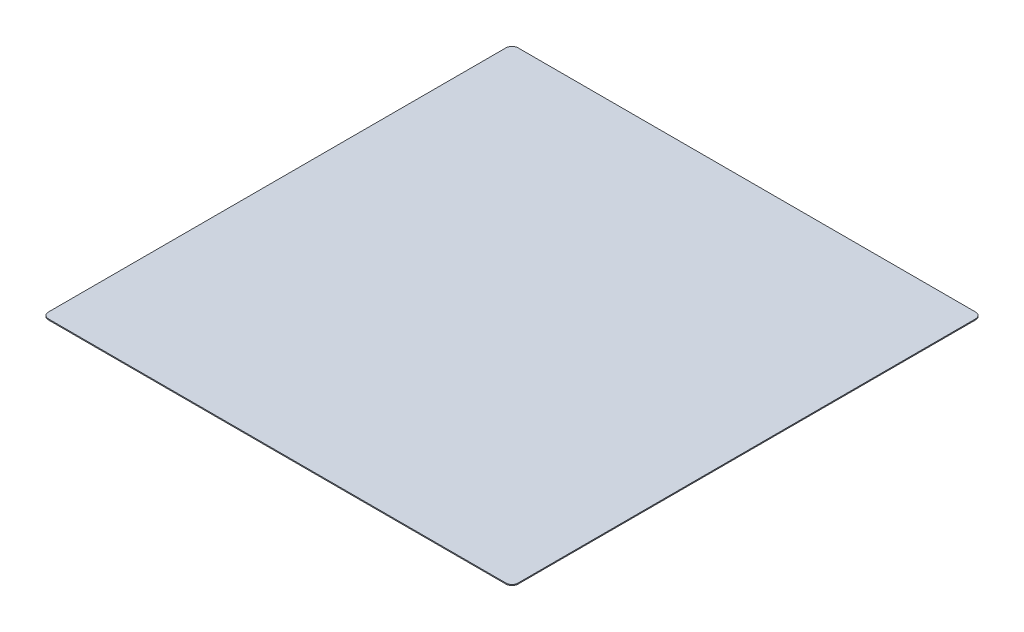
ISO-10303-21;
HEADER;
FILE_DESCRIPTION(('STEP AP214'),'2;1');
FILE_NAME('part.step','',(''),(''),'','','');
FILE_SCHEMA(('AUTOMOTIVE_DESIGN { 1 0 10303 214 1 1 1 1 }'));
ENDSEC;
DATA;
#1=APPLICATION_CONTEXT('core data for automotive mechanical design processes');
#2=APPLICATION_PROTOCOL_DEFINITION('international standard','automotive_design',2000,#1);
#3=PRODUCT_CONTEXT('',#1,'mechanical');
#4=PRODUCT('Part','Part','',(#3));
#5=PRODUCT_RELATED_PRODUCT_CATEGORY('part','',(#4));
#6=PRODUCT_DEFINITION_FORMATION('','',#4);
#7=PRODUCT_DEFINITION_CONTEXT('part definition',#1,'design');
#8=PRODUCT_DEFINITION('design','',#6,#7);
#9=PRODUCT_DEFINITION_SHAPE('','',#8);
#10=(LENGTH_UNIT() NAMED_UNIT(*) SI_UNIT(.MILLI.,.METRE.));
#11=(NAMED_UNIT(*) PLANE_ANGLE_UNIT() SI_UNIT($,.RADIAN.));
#12=(NAMED_UNIT(*) SI_UNIT($,.STERADIAN.) SOLID_ANGLE_UNIT());
#13=UNCERTAINTY_MEASURE_WITH_UNIT(LENGTH_MEASURE(1.E-05),#10,'distance_accuracy_value','');
#14=(GEOMETRIC_REPRESENTATION_CONTEXT(3) GLOBAL_UNCERTAINTY_ASSIGNED_CONTEXT((#13)) GLOBAL_UNIT_ASSIGNED_CONTEXT((#10,
#11,#12)) REPRESENTATION_CONTEXT('',''));
#15=CARTESIAN_POINT('',(0.,0.,0.));
#16=DIRECTION('',(0.,0.,1.));
#17=DIRECTION('',(1.,0.,0.));
#18=AXIS2_PLACEMENT_3D('',#15,#16,#17);
#19=CARTESIAN_POINT('',(-114.5,0.5,114.5));
#20=DIRECTION('',(0.,-1.,0.));
#21=DIRECTION('',(0.,0.,-1.));
#22=AXIS2_PLACEMENT_3D('',#19,#20,#21);
#23=CYLINDRICAL_SURFACE('',#22,3.);
#24=CARTESIAN_POINT('',(-114.5,0.,114.5));
#25=DIRECTION('',(0.,1.,0.));
#26=DIRECTION('',(0.,0.,1.));
#27=AXIS2_PLACEMENT_3D('',#24,#25,#26);
#28=CIRCLE('',#27,3.);
#29=CARTESIAN_POINT('',(-117.5,0.,114.5));
#30=VERTEX_POINT('',#29);
#31=CARTESIAN_POINT('',(-114.5,0.,117.5));
#32=VERTEX_POINT('',#31);
#33=EDGE_CURVE('E128',#30,#32,#28,.T.);
#34=ORIENTED_EDGE('',*,*,#33,.T.);
#35=DIRECTION('',(0.,-1.,0.));
#36=VECTOR('',#35,1.);
#37=CARTESIAN_POINT('',(-114.5,0.5,117.5));
#38=LINE('',#37,#36);
#39=CARTESIAN_POINT('',(-114.5,0.5,117.5));
#40=VERTEX_POINT('',#39);
#41=EDGE_CURVE('E11',#40,#32,#38,.T.);
#42=ORIENTED_EDGE('',*,*,#41,.F.);
#43=CARTESIAN_POINT('',(-114.5,0.5,114.5));
#44=DIRECTION('',(0.,1.,0.));
#45=DIRECTION('',(0.,0.,1.));
#46=AXIS2_PLACEMENT_3D('',#43,#44,#45);
#47=CIRCLE('',#46,3.);
#48=CARTESIAN_POINT('',(-117.5,0.5,114.5));
#49=VERTEX_POINT('',#48);
#50=EDGE_CURVE('E142',#49,#40,#47,.T.);
#51=ORIENTED_EDGE('',*,*,#50,.F.);
#52=DIRECTION('',(0.,-1.,0.));
#53=VECTOR('',#52,1.);
#54=CARTESIAN_POINT('',(-117.5,0.5,114.5));
#55=LINE('',#54,#53);
#56=EDGE_CURVE('E124',#49,#30,#55,.T.);
#57=ORIENTED_EDGE('',*,*,#56,.T.);
#58=EDGE_LOOP('',(#34,#42,#51,#57));
#59=FACE_BOUND('',#58,.T.);
#60=ADVANCED_FACE('F32',(#59),#23,.T.);
#61=CARTESIAN_POINT('',(-114.5,0.5,117.5));
#62=DIRECTION('',(0.,0.,-1.));
#63=DIRECTION('',(-1.,0.,0.));
#64=AXIS2_PLACEMENT_3D('',#61,#62,#63);
#65=PLANE('',#64);
#66=DIRECTION('',(1.,0.,0.));
#67=VECTOR('',#66,1.);
#68=CARTESIAN_POINT('',(-114.5,0.,117.5));
#69=LINE('',#68,#67);
#70=CARTESIAN_POINT('',(114.5,0.,117.5));
#71=VERTEX_POINT('',#70);
#72=EDGE_CURVE('E131',#32,#71,#69,.T.);
#73=ORIENTED_EDGE('',*,*,#72,.T.);
#74=DIRECTION('',(0.,-1.,0.));
#75=VECTOR('',#74,1.);
#76=CARTESIAN_POINT('',(114.5,0.5,117.5));
#77=LINE('',#76,#75);
#78=CARTESIAN_POINT('',(114.5,0.5,117.5));
#79=VERTEX_POINT('',#78);
#80=EDGE_CURVE('E40',#79,#71,#77,.T.);
#81=ORIENTED_EDGE('',*,*,#80,.F.);
#82=DIRECTION('',(1.,0.,0.));
#83=VECTOR('',#82,1.);
#84=CARTESIAN_POINT('',(-114.5,0.5,117.5));
#85=LINE('',#84,#83);
#86=EDGE_CURVE('E91',#40,#79,#85,.T.);
#87=ORIENTED_EDGE('',*,*,#86,.F.);
#88=ORIENTED_EDGE('',*,*,#41,.T.);
#89=EDGE_LOOP('',(#73,#81,#87,#88));
#90=FACE_BOUND('',#89,.T.);
#91=ADVANCED_FACE('F177',(#90),#65,.F.);
#92=CARTESIAN_POINT('',(114.5,0.5,114.5));
#93=DIRECTION('',(0.,-1.,0.));
#94=DIRECTION('',(0.,0.,-1.));
#95=AXIS2_PLACEMENT_3D('',#92,#93,#94);
#96=CYLINDRICAL_SURFACE('',#95,3.);
#97=CARTESIAN_POINT('',(114.5,0.,114.5));
#98=DIRECTION('',(0.,1.,0.));
#99=DIRECTION('',(0.,0.,1.));
#100=AXIS2_PLACEMENT_3D('',#97,#98,#99);
#101=CIRCLE('',#100,3.);
#102=CARTESIAN_POINT('',(117.5,0.,114.5));
#103=VERTEX_POINT('',#102);
#104=EDGE_CURVE('E133',#71,#103,#101,.T.);
#105=ORIENTED_EDGE('',*,*,#104,.T.);
#106=DIRECTION('',(0.,-1.,0.));
#107=VECTOR('',#106,1.);
#108=CARTESIAN_POINT('',(117.5,0.5,114.5));
#109=LINE('',#108,#107);
#110=CARTESIAN_POINT('',(117.5,0.5,114.5));
#111=VERTEX_POINT('',#110);
#112=EDGE_CURVE('E149',#111,#103,#109,.T.);
#113=ORIENTED_EDGE('',*,*,#112,.F.);
#114=CARTESIAN_POINT('',(114.5,0.5,114.5));
#115=DIRECTION('',(0.,1.,0.));
#116=DIRECTION('',(0.,0.,1.));
#117=AXIS2_PLACEMENT_3D('',#114,#115,#116);
#118=CIRCLE('',#117,3.);
#119=EDGE_CURVE('E157',#79,#111,#118,.T.);
#120=ORIENTED_EDGE('',*,*,#119,.F.);
#121=ORIENTED_EDGE('',*,*,#80,.T.);
#122=EDGE_LOOP('',(#105,#113,#120,#121));
#123=FACE_BOUND('',#122,.T.);
#124=ADVANCED_FACE('F155',(#123),#96,.T.);
#125=CARTESIAN_POINT('',(117.5,0.5,114.5));
#126=DIRECTION('',(-1.,0.,0.));
#127=DIRECTION('',(0.,0.,1.));
#128=AXIS2_PLACEMENT_3D('',#125,#126,#127);
#129=PLANE('',#128);
#130=DIRECTION('',(0.,0.,-1.));
#131=VECTOR('',#130,1.);
#132=CARTESIAN_POINT('',(117.5,0.,114.5));
#133=LINE('',#132,#131);
#134=CARTESIAN_POINT('',(117.5,0.,-114.5));
#135=VERTEX_POINT('',#134);
#136=EDGE_CURVE('E135',#103,#135,#133,.T.);
#137=ORIENTED_EDGE('',*,*,#136,.T.);
#138=DIRECTION('',(0.,-1.,0.));
#139=VECTOR('',#138,1.);
#140=CARTESIAN_POINT('',(117.5,0.5,-114.5));
#141=LINE('',#140,#139);
#142=CARTESIAN_POINT('',(117.5,0.5,-114.5));
#143=VERTEX_POINT('',#142);
#144=EDGE_CURVE('E146',#143,#135,#141,.T.);
#145=ORIENTED_EDGE('',*,*,#144,.F.);
#146=DIRECTION('',(0.,0.,-1.));
#147=VECTOR('',#146,1.);
#148=CARTESIAN_POINT('',(117.5,0.5,114.5));
#149=LINE('',#148,#147);
#150=EDGE_CURVE('E169',#111,#143,#149,.T.);
#151=ORIENTED_EDGE('',*,*,#150,.F.);
#152=ORIENTED_EDGE('',*,*,#112,.T.);
#153=EDGE_LOOP('',(#137,#145,#151,#152));
#154=FACE_BOUND('',#153,.T.);
#155=ADVANCED_FACE('F165',(#154),#129,.F.);
#156=CARTESIAN_POINT('',(114.5,0.5,-114.5));
#157=DIRECTION('',(0.,-1.,0.));
#158=DIRECTION('',(0.,0.,-1.));
#159=AXIS2_PLACEMENT_3D('',#156,#157,#158);
#160=CYLINDRICAL_SURFACE('',#159,3.);
#161=CARTESIAN_POINT('',(114.5,0.,-114.5));
#162=DIRECTION('',(0.,1.,0.));
#163=DIRECTION('',(0.,0.,1.));
#164=AXIS2_PLACEMENT_3D('',#161,#162,#163);
#165=CIRCLE('',#164,3.);
#166=CARTESIAN_POINT('',(114.5,0.,-117.5));
#167=VERTEX_POINT('',#166);
#168=EDGE_CURVE('E137',#135,#167,#165,.T.);
#169=ORIENTED_EDGE('',*,*,#168,.T.);
#170=DIRECTION('',(0.,-1.,0.));
#171=VECTOR('',#170,1.);
#172=CARTESIAN_POINT('',(114.5,0.5,-117.5));
#173=LINE('',#172,#171);
#174=CARTESIAN_POINT('',(114.5,0.5,-117.5));
#175=VERTEX_POINT('',#174);
#176=EDGE_CURVE('E119',#175,#167,#173,.T.);
#177=ORIENTED_EDGE('',*,*,#176,.F.);
#178=CARTESIAN_POINT('',(114.5,0.5,-114.5));
#179=DIRECTION('',(0.,1.,0.));
#180=DIRECTION('',(0.,0.,1.));
#181=AXIS2_PLACEMENT_3D('',#178,#179,#180);
#182=CIRCLE('',#181,3.);
#183=EDGE_CURVE('E110',#143,#175,#182,.T.);
#184=ORIENTED_EDGE('',*,*,#183,.F.);
#185=ORIENTED_EDGE('',*,*,#144,.T.);
#186=EDGE_LOOP('',(#169,#177,#184,#185));
#187=FACE_BOUND('',#186,.T.);
#188=ADVANCED_FACE('F168',(#187),#160,.T.);
#189=CARTESIAN_POINT('',(114.5,0.5,-117.5));
#190=DIRECTION('',(0.,0.,1.));
#191=DIRECTION('',(1.,0.,0.));
#192=AXIS2_PLACEMENT_3D('',#189,#190,#191);
#193=PLANE('',#192);
#194=DIRECTION('',(-1.,0.,0.));
#195=VECTOR('',#194,1.);
#196=CARTESIAN_POINT('',(114.5,0.,-117.5));
#197=LINE('',#196,#195);
#198=CARTESIAN_POINT('',(-114.5,0.,-117.5));
#199=VERTEX_POINT('',#198);
#200=EDGE_CURVE('E118',#167,#199,#197,.T.);
#201=ORIENTED_EDGE('',*,*,#200,.T.);
#202=DIRECTION('',(0.,-1.,0.));
#203=VECTOR('',#202,1.);
#204=CARTESIAN_POINT('',(-114.5,0.5,-117.5));
#205=LINE('',#204,#203);
#206=CARTESIAN_POINT('',(-114.5,0.5,-117.5));
#207=VERTEX_POINT('',#206);
#208=EDGE_CURVE('E115',#207,#199,#205,.T.);
#209=ORIENTED_EDGE('',*,*,#208,.F.);
#210=DIRECTION('',(-1.,0.,0.));
#211=VECTOR('',#210,1.);
#212=CARTESIAN_POINT('',(114.5,0.5,-117.5));
#213=LINE('',#212,#211);
#214=EDGE_CURVE('E104',#175,#207,#213,.T.);
#215=ORIENTED_EDGE('',*,*,#214,.F.);
#216=ORIENTED_EDGE('',*,*,#176,.T.);
#217=EDGE_LOOP('',(#201,#209,#215,#216));
#218=FACE_BOUND('',#217,.T.);
#219=ADVANCED_FACE('F116',(#218),#193,.F.);
#220=CARTESIAN_POINT('',(-114.5,0.5,-114.5));
#221=DIRECTION('',(0.,-1.,0.));
#222=DIRECTION('',(0.,0.,-1.));
#223=AXIS2_PLACEMENT_3D('',#220,#221,#222);
#224=CYLINDRICAL_SURFACE('',#223,3.);
#225=CARTESIAN_POINT('',(-114.5,0.,-114.5));
#226=DIRECTION('',(0.,1.,0.));
#227=DIRECTION('',(0.,0.,1.));
#228=AXIS2_PLACEMENT_3D('',#225,#226,#227);
#229=CIRCLE('',#228,3.);
#230=CARTESIAN_POINT('',(-117.5,0.,-114.5));
#231=VERTEX_POINT('',#230);
#232=EDGE_CURVE('E77',#199,#231,#229,.T.);
#233=ORIENTED_EDGE('',*,*,#232,.T.);
#234=DIRECTION('',(0.,-1.,0.));
#235=VECTOR('',#234,1.);
#236=CARTESIAN_POINT('',(-117.5,0.5,-114.5));
#237=LINE('',#236,#235);
#238=CARTESIAN_POINT('',(-117.5,0.5,-114.5));
#239=VERTEX_POINT('',#238);
#240=EDGE_CURVE('E120',#239,#231,#237,.T.);
#241=ORIENTED_EDGE('',*,*,#240,.F.);
#242=CARTESIAN_POINT('',(-114.5,0.5,-114.5));
#243=DIRECTION('',(0.,1.,0.));
#244=DIRECTION('',(0.,0.,1.));
#245=AXIS2_PLACEMENT_3D('',#242,#243,#244);
#246=CIRCLE('',#245,3.);
#247=EDGE_CURVE('E108',#207,#239,#246,.T.);
#248=ORIENTED_EDGE('',*,*,#247,.F.);
#249=ORIENTED_EDGE('',*,*,#208,.T.);
#250=EDGE_LOOP('',(#233,#241,#248,#249));
#251=FACE_BOUND('',#250,.T.);
#252=ADVANCED_FACE('F122',(#251),#224,.T.);
#253=CARTESIAN_POINT('',(-117.5,0.5,-114.5));
#254=DIRECTION('',(1.,0.,0.));
#255=DIRECTION('',(0.,0.,-1.));
#256=AXIS2_PLACEMENT_3D('',#253,#254,#255);
#257=PLANE('',#256);
#258=DIRECTION('',(0.,0.,1.));
#259=VECTOR('',#258,1.);
#260=CARTESIAN_POINT('',(-117.5,0.,-114.5));
#261=LINE('',#260,#259);
#262=EDGE_CURVE('E83',#231,#30,#261,.T.);
#263=ORIENTED_EDGE('',*,*,#262,.T.);
#264=ORIENTED_EDGE('',*,*,#56,.F.);
#265=DIRECTION('',(0.,0.,1.));
#266=VECTOR('',#265,1.);
#267=CARTESIAN_POINT('',(-117.5,0.5,-114.5));
#268=LINE('',#267,#266);
#269=EDGE_CURVE('E48',#239,#49,#268,.T.);
#270=ORIENTED_EDGE('',*,*,#269,.F.);
#271=ORIENTED_EDGE('',*,*,#240,.T.);
#272=EDGE_LOOP('',(#263,#264,#270,#271));
#273=FACE_BOUND('',#272,.T.);
#274=ADVANCED_FACE('F193',(#273),#257,.F.);
#275=CARTESIAN_POINT('',(-114.5,0.5,114.5));
#276=DIRECTION('',(0.,1.,0.));
#277=DIRECTION('',(0.,0.,1.));
#278=AXIS2_PLACEMENT_3D('',#275,#276,#277);
#279=PLANE('',#278);
#280=ORIENTED_EDGE('',*,*,#50,.T.);
#281=ORIENTED_EDGE('',*,*,#86,.T.);
#282=ORIENTED_EDGE('',*,*,#119,.T.);
#283=ORIENTED_EDGE('',*,*,#150,.T.);
#284=ORIENTED_EDGE('',*,*,#183,.T.);
#285=ORIENTED_EDGE('',*,*,#214,.T.);
#286=ORIENTED_EDGE('',*,*,#247,.T.);
#287=ORIENTED_EDGE('',*,*,#269,.T.);
#288=EDGE_LOOP('',(#280,#281,#282,#283,#284,#285,#286,#287));
#289=FACE_BOUND('',#288,.T.);
#290=ADVANCED_FACE('F106',(#289),#279,.T.);
#291=CARTESIAN_POINT('',(-114.5,0.,114.5));
#292=DIRECTION('',(0.,1.,0.));
#293=DIRECTION('',(0.,0.,1.));
#294=AXIS2_PLACEMENT_3D('',#291,#292,#293);
#295=PLANE('',#294);
#296=ORIENTED_EDGE('',*,*,#33,.F.);
#297=ORIENTED_EDGE('',*,*,#262,.F.);
#298=ORIENTED_EDGE('',*,*,#232,.F.);
#299=ORIENTED_EDGE('',*,*,#200,.F.);
#300=ORIENTED_EDGE('',*,*,#168,.F.);
#301=ORIENTED_EDGE('',*,*,#136,.F.);
#302=ORIENTED_EDGE('',*,*,#104,.F.);
#303=ORIENTED_EDGE('',*,*,#72,.F.);
#304=EDGE_LOOP('',(#296,#297,#298,#299,#300,#301,#302,#303));
#305=FACE_BOUND('',#304,.T.);
#306=ADVANCED_FACE('F161',(#305),#295,.F.);
#307=CLOSED_SHELL('',(#60,#91,#124,#155,#188,#219,#252,#274,#290,#306));
#308=MANIFOLD_SOLID_BREP('B2',#307);
#309=ADVANCED_BREP_SHAPE_REPRESENTATION('',(#18,#308),#14);
#310=SHAPE_DEFINITION_REPRESENTATION(#9,#309);
ENDSEC;
END-ISO-10303-21;
